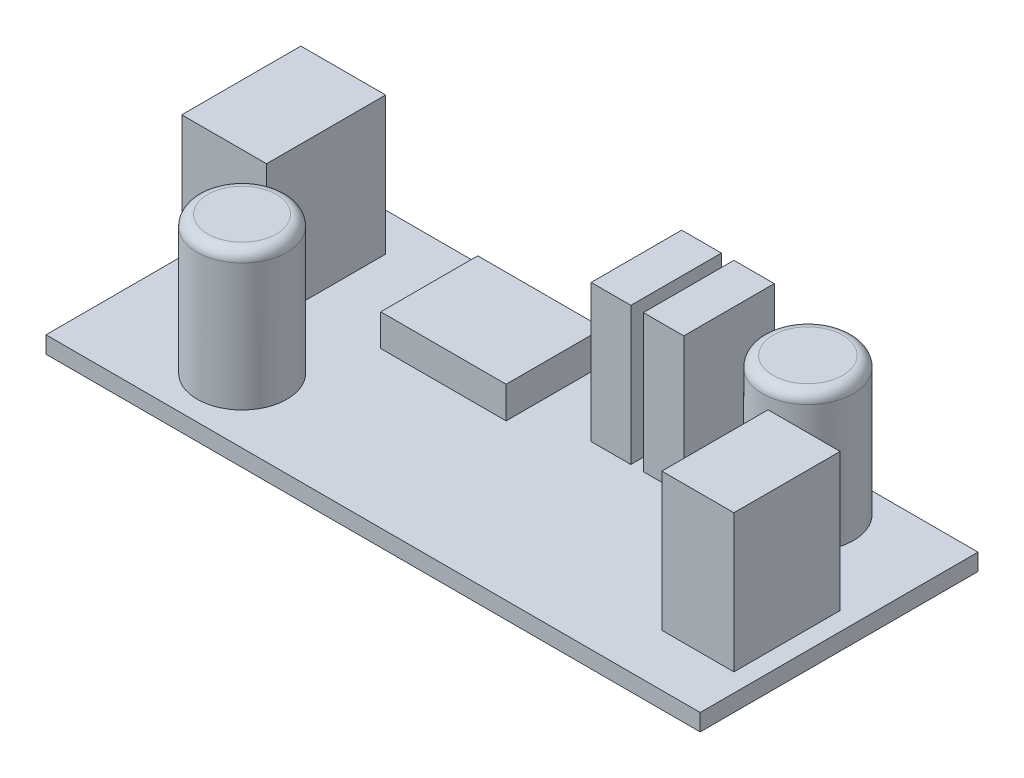
ISO-10303-21;
HEADER;
FILE_DESCRIPTION(('STEP AP214'),'2;1');
FILE_NAME('part.step','',(''),(''),'','','');
FILE_SCHEMA(('AUTOMOTIVE_DESIGN { 1 0 10303 214 1 1 1 1 }'));
ENDSEC;
DATA;
#1=APPLICATION_CONTEXT('core data for automotive mechanical design processes');
#2=APPLICATION_PROTOCOL_DEFINITION('international standard','automotive_design',2000,#1);
#3=PRODUCT_CONTEXT('',#1,'mechanical');
#4=PRODUCT('Part','Part','',(#3));
#5=PRODUCT_RELATED_PRODUCT_CATEGORY('part','',(#4));
#6=PRODUCT_DEFINITION_FORMATION('','',#4);
#7=PRODUCT_DEFINITION_CONTEXT('part definition',#1,'design');
#8=PRODUCT_DEFINITION('design','',#6,#7);
#9=PRODUCT_DEFINITION_SHAPE('','',#8);
#10=(LENGTH_UNIT() NAMED_UNIT(*) SI_UNIT(.MILLI.,.METRE.));
#11=(NAMED_UNIT(*) PLANE_ANGLE_UNIT() SI_UNIT($,.RADIAN.));
#12=(NAMED_UNIT(*) SI_UNIT($,.STERADIAN.) SOLID_ANGLE_UNIT());
#13=UNCERTAINTY_MEASURE_WITH_UNIT(LENGTH_MEASURE(1.E-05),#10,'distance_accuracy_value','');
#14=(GEOMETRIC_REPRESENTATION_CONTEXT(3) GLOBAL_UNCERTAINTY_ASSIGNED_CONTEXT((#13)) GLOBAL_UNIT_ASSIGNED_CONTEXT((#10,
#11,#12)) REPRESENTATION_CONTEXT('',''));
#15=CARTESIAN_POINT('',(0.,0.,0.));
#16=DIRECTION('',(0.,0.,1.));
#17=DIRECTION('',(1.,0.,0.));
#18=AXIS2_PLACEMENT_3D('',#15,#16,#17);
#19=CARTESIAN_POINT('',(0.,1.59,0.));
#20=DIRECTION('',(0.,-1.,0.));
#21=DIRECTION('',(0.,0.,-1.));
#22=AXIS2_PLACEMENT_3D('',#19,#20,#21);
#23=PLANE('',#22);
#24=CARTESIAN_POINT('',(12.398624263227,1.59,-6.0956552254664));
#25=DIRECTION('',(0.,-1.,0.));
#26=DIRECTION('',(0.,0.,-1.));
#27=AXIS2_PLACEMENT_3D('',#24,#25,#26);
#28=CIRCLE('',#27,4.23346182279782);
#29=CARTESIAN_POINT('',(12.398624263227,1.59,-10.3291170482642));
#30=VERTEX_POINT('',#29);
#31=EDGE_CURVE('E386',#30,#30,#28,.F.);
#32=ORIENTED_EDGE('',*,*,#31,.F.);
#33=EDGE_LOOP('',(#32));
#34=FACE_BOUND('',#33,.T.);
#35=DIRECTION('',(0.,0.,1.));
#36=VECTOR('',#35,1.);
#37=CARTESIAN_POINT('',(39.3579489685933,1.59,-25.5244355498974));
#38=LINE('',#37,#36);
#39=CARTESIAN_POINT('',(39.3579489685933,1.59,-25.5244355498974));
#40=VERTEX_POINT('',#39);
#41=CARTESIAN_POINT('',(39.3579489685933,1.59,-16.9866949518898));
#42=VERTEX_POINT('',#41);
#43=EDGE_CURVE('E216',#40,#42,#38,.T.);
#44=ORIENTED_EDGE('',*,*,#43,.F.);
#45=DIRECTION('',(-1.,0.,0.));
#46=VECTOR('',#45,1.);
#47=CARTESIAN_POINT('',(39.3579489685933,1.59,-25.5244355498974));
#48=LINE('',#47,#46);
#49=CARTESIAN_POINT('',(43.1627428834531,1.59,-25.5244355498974));
#50=VERTEX_POINT('',#49);
#51=EDGE_CURVE('E229',#50,#40,#48,.T.);
#52=ORIENTED_EDGE('',*,*,#51,.F.);
#53=DIRECTION('',(0.,0.,-1.));
#54=VECTOR('',#53,1.);
#55=CARTESIAN_POINT('',(43.1627428834531,1.59,-25.5244355498974));
#56=LINE('',#55,#54);
#57=CARTESIAN_POINT('',(43.1627428834531,1.59,-16.9866949518898));
#58=VERTEX_POINT('',#57);
#59=EDGE_CURVE('E238',#58,#50,#56,.T.);
#60=ORIENTED_EDGE('',*,*,#59,.F.);
#61=DIRECTION('',(1.,0.,0.));
#62=VECTOR('',#61,1.);
#63=CARTESIAN_POINT('',(39.3579489685933,1.59,-16.9866949518898));
#64=LINE('',#63,#62);
#65=EDGE_CURVE('E219',#42,#58,#64,.T.);
#66=ORIENTED_EDGE('',*,*,#65,.F.);
#67=EDGE_LOOP('',(#44,#52,#60,#66));
#68=FACE_BOUND('',#67,.T.);
#69=DIRECTION('',(0.,0.,1.));
#70=VECTOR('',#69,1.);
#71=CARTESIAN_POINT('',(53.1758245260932,1.59,-14.9218329152525));
#72=LINE('',#71,#70);
#73=CARTESIAN_POINT('',(53.1758245260932,1.59,-14.9218329152525));
#74=VERTEX_POINT('',#73);
#75=CARTESIAN_POINT('',(53.1758245260932,1.59,-4.90639908178636));
#76=VERTEX_POINT('',#75);
#77=EDGE_CURVE('E287',#74,#76,#72,.T.);
#78=ORIENTED_EDGE('',*,*,#77,.F.);
#79=DIRECTION('',(-1.,0.,0.));
#80=VECTOR('',#79,1.);
#81=CARTESIAN_POINT('',(53.1758245260932,1.59,-14.9218329152525));
#82=LINE('',#81,#80);
#83=CARTESIAN_POINT('',(59.9732286864523,1.59,-14.9218329152525));
#84=VERTEX_POINT('',#83);
#85=EDGE_CURVE('E292',#84,#74,#82,.T.);
#86=ORIENTED_EDGE('',*,*,#85,.F.);
#87=DIRECTION('',(0.,0.,-1.));
#88=VECTOR('',#87,1.);
#89=CARTESIAN_POINT('',(59.9732286864523,1.59,-14.9218329152525));
#90=LINE('',#89,#88);
#91=CARTESIAN_POINT('',(59.9732286864523,1.59,-4.90639908178636));
#92=VERTEX_POINT('',#91);
#93=EDGE_CURVE('E304',#92,#84,#90,.T.);
#94=ORIENTED_EDGE('',*,*,#93,.F.);
#95=DIRECTION('',(1.,0.,0.));
#96=VECTOR('',#95,1.);
#97=CARTESIAN_POINT('',(53.1758245260932,1.59,-4.90639908178636));
#98=LINE('',#97,#96);
#99=EDGE_CURVE('E301',#76,#92,#98,.T.);
#100=ORIENTED_EDGE('',*,*,#99,.F.);
#101=EDGE_LOOP('',(#78,#86,#94,#100));
#102=FACE_BOUND('',#101,.T.);
#103=DIRECTION('',(0.,0.,1.));
#104=VECTOR('',#103,1.);
#105=CARTESIAN_POINT('',(0.,1.59,0.));
#106=LINE('',#105,#104);
#107=CARTESIAN_POINT('',(0.,1.59,-26.2));
#108=VERTEX_POINT('',#107);
#109=CARTESIAN_POINT('',(0.,1.59,0.));
#110=VERTEX_POINT('',#109);
#111=EDGE_CURVE('E354',#108,#110,#106,.T.);
#112=ORIENTED_EDGE('',*,*,#111,.T.);
#113=DIRECTION('',(1.,0.,0.));
#114=VECTOR('',#113,1.);
#115=CARTESIAN_POINT('',(0.,1.59,0.));
#116=LINE('',#115,#114);
#117=CARTESIAN_POINT('',(61.7,1.59,0.));
#118=VERTEX_POINT('',#117);
#119=EDGE_CURVE('E357',#110,#118,#116,.T.);
#120=ORIENTED_EDGE('',*,*,#119,.T.);
#121=DIRECTION('',(0.,0.,-1.));
#122=VECTOR('',#121,1.);
#123=CARTESIAN_POINT('',(61.7,1.59,0.));
#124=LINE('',#123,#122);
#125=CARTESIAN_POINT('',(61.7,1.59,-26.2));
#126=VERTEX_POINT('',#125);
#127=EDGE_CURVE('E360',#118,#126,#124,.T.);
#128=ORIENTED_EDGE('',*,*,#127,.T.);
#129=DIRECTION('',(-1.,0.,0.));
#130=VECTOR('',#129,1.);
#131=CARTESIAN_POINT('',(0.,1.59,-26.2));
#132=LINE('',#131,#130);
#133=EDGE_CURVE('E362',#126,#108,#132,.T.);
#134=ORIENTED_EDGE('',*,*,#133,.T.);
#135=EDGE_LOOP('',(#112,#120,#128,#134));
#136=FACE_BOUND('',#135,.T.);
#137=DIRECTION('',(0.,0.,1.));
#138=VECTOR('',#137,1.);
#139=CARTESIAN_POINT('',(1.43322798709278,1.59,-22.6025100277512));
#140=LINE('',#139,#138);
#141=CARTESIAN_POINT('',(1.43322798709278,1.59,-22.6025100277512));
#142=VERTEX_POINT('',#141);
#143=CARTESIAN_POINT('',(1.43322798709278,1.59,-11.3708798760284));
#144=VERTEX_POINT('',#143);
#145=EDGE_CURVE('E320',#142,#144,#140,.T.);
#146=ORIENTED_EDGE('',*,*,#145,.F.);
#147=DIRECTION('',(-1.,0.,0.));
#148=VECTOR('',#147,1.);
#149=CARTESIAN_POINT('',(1.43322798709278,1.59,-22.6025100277512));
#150=LINE('',#149,#148);
#151=CARTESIAN_POINT('',(9.42951907842371,1.59,-22.6025100277512));
#152=VERTEX_POINT('',#151);
#153=EDGE_CURVE('E325',#152,#142,#150,.T.);
#154=ORIENTED_EDGE('',*,*,#153,.F.);
#155=DIRECTION('',(0.,0.,-1.));
#156=VECTOR('',#155,1.);
#157=CARTESIAN_POINT('',(9.42951907842371,1.59,-22.6025100277512));
#158=LINE('',#157,#156);
#159=CARTESIAN_POINT('',(9.42951907842371,1.59,-11.3708798760284));
#160=VERTEX_POINT('',#159);
#161=EDGE_CURVE('E337',#160,#152,#158,.T.);
#162=ORIENTED_EDGE('',*,*,#161,.F.);
#163=DIRECTION('',(1.,0.,0.));
#164=VECTOR('',#163,1.);
#165=CARTESIAN_POINT('',(1.43322798709278,1.59,-11.3708798760284));
#166=LINE('',#165,#164);
#167=EDGE_CURVE('E334',#144,#160,#166,.T.);
#168=ORIENTED_EDGE('',*,*,#167,.F.);
#169=EDGE_LOOP('',(#146,#154,#162,#168));
#170=FACE_BOUND('',#169,.T.);
#171=DIRECTION('',(0.,0.,1.));
#172=VECTOR('',#171,1.);
#173=CARTESIAN_POINT('',(34.429265792177,1.59,-25.5244355498974));
#174=LINE('',#173,#172);
#175=CARTESIAN_POINT('',(34.429265792177,1.59,-25.5244355498974));
#176=VERTEX_POINT('',#175);
#177=CARTESIAN_POINT('',(34.429265792177,1.59,-16.9866949518898));
#178=VERTEX_POINT('',#177);
#179=EDGE_CURVE('E254',#176,#178,#174,.T.);
#180=ORIENTED_EDGE('',*,*,#179,.F.);
#181=DIRECTION('',(-1.,0.,0.));
#182=VECTOR('',#181,1.);
#183=CARTESIAN_POINT('',(34.429265792177,1.59,-25.5244355498974));
#184=LINE('',#183,#182);
#185=CARTESIAN_POINT('',(38.1737413464904,1.59,-25.5244355498974));
#186=VERTEX_POINT('',#185);
#187=EDGE_CURVE('E259',#186,#176,#184,.T.);
#188=ORIENTED_EDGE('',*,*,#187,.F.);
#189=DIRECTION('',(0.,0.,-1.));
#190=VECTOR('',#189,1.);
#191=CARTESIAN_POINT('',(38.1737413464904,1.59,-25.5244355498974));
#192=LINE('',#191,#190);
#193=CARTESIAN_POINT('',(38.1737413464904,1.59,-16.9866949518898));
#194=VERTEX_POINT('',#193);
#195=EDGE_CURVE('E271',#194,#186,#192,.T.);
#196=ORIENTED_EDGE('',*,*,#195,.F.);
#197=DIRECTION('',(1.,0.,0.));
#198=VECTOR('',#197,1.);
#199=CARTESIAN_POINT('',(34.429265792177,1.59,-16.9866949518898));
#200=LINE('',#199,#198);
#201=EDGE_CURVE('E268',#178,#194,#200,.T.);
#202=ORIENTED_EDGE('',*,*,#201,.F.);
#203=EDGE_LOOP('',(#180,#188,#196,#202));
#204=FACE_BOUND('',#203,.T.);
#205=CARTESIAN_POINT('',(50.6011950510867,1.59,-21.2555652508936));
#206=DIRECTION('',(0.,-1.,0.));
#207=DIRECTION('',(0.,0.,-1.));
#208=AXIS2_PLACEMENT_3D('',#205,#206,#207);
#209=CIRCLE('',#208,4.28421693215345);
#210=CARTESIAN_POINT('',(50.6011950510867,1.59,-25.539782183047));
#211=VERTEX_POINT('',#210);
#212=EDGE_CURVE('E383',#211,#211,#209,.F.);
#213=ORIENTED_EDGE('',*,*,#212,.F.);
#214=EDGE_LOOP('',(#213));
#215=FACE_BOUND('',#214,.T.);
#216=DIRECTION('',(0.,0.,1.));
#217=VECTOR('',#216,1.);
#218=CARTESIAN_POINT('',(16.9088751946092,1.59,-23.8112295997852));
#219=LINE('',#218,#217);
#220=CARTESIAN_POINT('',(16.9088751946092,1.59,-23.8112295997852));
#221=VERTEX_POINT('',#220);
#222=CARTESIAN_POINT('',(16.9088751946092,1.59,-14.6618184301883));
#223=VERTEX_POINT('',#222);
#224=EDGE_CURVE('E215',#221,#223,#219,.T.);
#225=ORIENTED_EDGE('',*,*,#224,.F.);
#226=DIRECTION('',(-1.,0.,0.));
#227=VECTOR('',#226,1.);
#228=CARTESIAN_POINT('',(16.9088751946092,1.59,-23.8112295997852));
#229=LINE('',#228,#227);
#230=CARTESIAN_POINT('',(28.7336803821319,1.59,-23.8112295997852));
#231=VERTEX_POINT('',#230);
#232=EDGE_CURVE('E212',#231,#221,#229,.T.);
#233=ORIENTED_EDGE('',*,*,#232,.F.);
#234=DIRECTION('',(0.,0.,-1.));
#235=VECTOR('',#234,1.);
#236=CARTESIAN_POINT('',(28.7336803821319,1.59,-23.8112295997852));
#237=LINE('',#236,#235);
#238=CARTESIAN_POINT('',(28.7336803821319,1.59,-14.6618184301883));
#239=VERTEX_POINT('',#238);
#240=EDGE_CURVE('E54',#239,#231,#237,.T.);
#241=ORIENTED_EDGE('',*,*,#240,.F.);
#242=DIRECTION('',(1.,0.,0.));
#243=VECTOR('',#242,1.);
#244=CARTESIAN_POINT('',(16.9088751946092,1.59,-14.6618184301883));
#245=LINE('',#244,#243);
#246=EDGE_CURVE('E49',#223,#239,#245,.T.);
#247=ORIENTED_EDGE('',*,*,#246,.F.);
#248=EDGE_LOOP('',(#225,#233,#241,#247));
#249=FACE_BOUND('',#248,.T.);
#250=ADVANCED_FACE('F34',(#34,#68,#102,#136,#170,#204,#215,#249),#23,.F.);
#251=CARTESIAN_POINT('',(0.,1.59,0.));
#252=DIRECTION('',(1.,0.,0.));
#253=DIRECTION('',(0.,0.,-1.));
#254=AXIS2_PLACEMENT_3D('',#251,#252,#253);
#255=PLANE('',#254);
#256=DIRECTION('',(0.,0.,1.));
#257=VECTOR('',#256,1.);
#258=CARTESIAN_POINT('',(0.,0.,0.));
#259=LINE('',#258,#257);
#260=CARTESIAN_POINT('',(0.,0.,-26.2));
#261=VERTEX_POINT('',#260);
#262=CARTESIAN_POINT('',(0.,0.,0.));
#263=VERTEX_POINT('',#262);
#264=EDGE_CURVE('E353',#261,#263,#259,.T.);
#265=ORIENTED_EDGE('',*,*,#264,.T.);
#266=DIRECTION('',(0.,-1.,0.));
#267=VECTOR('',#266,1.);
#268=CARTESIAN_POINT('',(0.,1.59,0.));
#269=LINE('',#268,#267);
#270=EDGE_CURVE('E380',#110,#263,#269,.T.);
#271=ORIENTED_EDGE('',*,*,#270,.F.);
#272=ORIENTED_EDGE('',*,*,#111,.F.);
#273=DIRECTION('',(0.,-1.,0.));
#274=VECTOR('',#273,1.);
#275=CARTESIAN_POINT('',(0.,1.59,-26.2));
#276=LINE('',#275,#274);
#277=EDGE_CURVE('E364',#108,#261,#276,.T.);
#278=ORIENTED_EDGE('',*,*,#277,.T.);
#279=EDGE_LOOP('',(#265,#271,#272,#278));
#280=FACE_BOUND('',#279,.T.);
#281=ADVANCED_FACE('F410',(#280),#255,.F.);
#282=CARTESIAN_POINT('',(0.,1.59,0.));
#283=DIRECTION('',(0.,0.,-1.));
#284=DIRECTION('',(-1.,0.,0.));
#285=AXIS2_PLACEMENT_3D('',#282,#283,#284);
#286=PLANE('',#285);
#287=DIRECTION('',(1.,0.,0.));
#288=VECTOR('',#287,1.);
#289=CARTESIAN_POINT('',(0.,0.,0.));
#290=LINE('',#289,#288);
#291=CARTESIAN_POINT('',(61.7,0.,0.));
#292=VERTEX_POINT('',#291);
#293=EDGE_CURVE('E367',#263,#292,#290,.T.);
#294=ORIENTED_EDGE('',*,*,#293,.T.);
#295=DIRECTION('',(0.,-1.,0.));
#296=VECTOR('',#295,1.);
#297=CARTESIAN_POINT('',(61.7,1.59,0.));
#298=LINE('',#297,#296);
#299=EDGE_CURVE('E377',#118,#292,#298,.T.);
#300=ORIENTED_EDGE('',*,*,#299,.F.);
#301=ORIENTED_EDGE('',*,*,#119,.F.);
#302=ORIENTED_EDGE('',*,*,#270,.T.);
#303=EDGE_LOOP('',(#294,#300,#301,#302));
#304=FACE_BOUND('',#303,.T.);
#305=ADVANCED_FACE('F416',(#304),#286,.F.);
#306=CARTESIAN_POINT('',(61.7,1.59,0.));
#307=DIRECTION('',(-1.,0.,0.));
#308=DIRECTION('',(0.,0.,1.));
#309=AXIS2_PLACEMENT_3D('',#306,#307,#308);
#310=PLANE('',#309);
#311=DIRECTION('',(0.,0.,-1.));
#312=VECTOR('',#311,1.);
#313=CARTESIAN_POINT('',(61.7,0.,0.));
#314=LINE('',#313,#312);
#315=CARTESIAN_POINT('',(61.7,0.,-26.2));
#316=VERTEX_POINT('',#315);
#317=EDGE_CURVE('E369',#292,#316,#314,.T.);
#318=ORIENTED_EDGE('',*,*,#317,.T.);
#319=DIRECTION('',(0.,-1.,0.));
#320=VECTOR('',#319,1.);
#321=CARTESIAN_POINT('',(61.7,1.59,-26.2));
#322=LINE('',#321,#320);
#323=EDGE_CURVE('E374',#126,#316,#322,.T.);
#324=ORIENTED_EDGE('',*,*,#323,.F.);
#325=ORIENTED_EDGE('',*,*,#127,.F.);
#326=ORIENTED_EDGE('',*,*,#299,.T.);
#327=EDGE_LOOP('',(#318,#324,#325,#326));
#328=FACE_BOUND('',#327,.T.);
#329=ADVANCED_FACE('F432',(#328),#310,.F.);
#330=CARTESIAN_POINT('',(0.,1.59,-26.2));
#331=DIRECTION('',(0.,0.,1.));
#332=DIRECTION('',(1.,0.,0.));
#333=AXIS2_PLACEMENT_3D('',#330,#331,#332);
#334=PLANE('',#333);
#335=DIRECTION('',(-1.,0.,0.));
#336=VECTOR('',#335,1.);
#337=CARTESIAN_POINT('',(0.,0.,-26.2));
#338=LINE('',#337,#336);
#339=EDGE_CURVE('E358',#316,#261,#338,.T.);
#340=ORIENTED_EDGE('',*,*,#339,.T.);
#341=ORIENTED_EDGE('',*,*,#277,.F.);
#342=ORIENTED_EDGE('',*,*,#133,.F.);
#343=ORIENTED_EDGE('',*,*,#323,.T.);
#344=EDGE_LOOP('',(#340,#341,#342,#343));
#345=FACE_BOUND('',#344,.T.);
#346=ADVANCED_FACE('F428',(#345),#334,.F.);
#347=CARTESIAN_POINT('',(0.,0.,0.));
#348=DIRECTION('',(0.,-1.,0.));
#349=DIRECTION('',(0.,0.,-1.));
#350=AXIS2_PLACEMENT_3D('',#347,#348,#349);
#351=PLANE('',#350);
#352=ORIENTED_EDGE('',*,*,#264,.F.);
#353=ORIENTED_EDGE('',*,*,#339,.F.);
#354=ORIENTED_EDGE('',*,*,#317,.F.);
#355=ORIENTED_EDGE('',*,*,#293,.F.);
#356=EDGE_LOOP('',(#352,#353,#354,#355));
#357=FACE_BOUND('',#356,.T.);
#358=ADVANCED_FACE('F425',(#357),#351,.T.);
#359=CARTESIAN_POINT('',(1.43322798709278,14.59,-22.6025100277512));
#360=DIRECTION('',(1.,0.,0.));
#361=DIRECTION('',(0.,0.,-1.));
#362=AXIS2_PLACEMENT_3D('',#359,#360,#361);
#363=PLANE('',#362);
#364=ORIENTED_EDGE('',*,*,#145,.T.);
#365=DIRECTION('',(0.,-1.,0.));
#366=VECTOR('',#365,1.);
#367=CARTESIAN_POINT('',(1.43322798709278,14.59,-11.3708798760284));
#368=LINE('',#367,#366);
#369=CARTESIAN_POINT('',(1.43322798709278,14.59,-11.3708798760284));
#370=VERTEX_POINT('',#369);
#371=EDGE_CURVE('E350',#370,#144,#368,.T.);
#372=ORIENTED_EDGE('',*,*,#371,.F.);
#373=DIRECTION('',(0.,0.,1.));
#374=VECTOR('',#373,1.);
#375=CARTESIAN_POINT('',(1.43322798709278,14.59,-22.6025100277512));
#376=LINE('',#375,#374);
#377=CARTESIAN_POINT('',(1.43322798709278,14.59,-22.6025100277512));
#378=VERTEX_POINT('',#377);
#379=EDGE_CURVE('E321',#378,#370,#376,.T.);
#380=ORIENTED_EDGE('',*,*,#379,.F.);
#381=DIRECTION('',(0.,-1.,0.));
#382=VECTOR('',#381,1.);
#383=CARTESIAN_POINT('',(1.43322798709278,14.59,-22.6025100277512));
#384=LINE('',#383,#382);
#385=EDGE_CURVE('E331',#378,#142,#384,.T.);
#386=ORIENTED_EDGE('',*,*,#385,.T.);
#387=EDGE_LOOP('',(#364,#372,#380,#386));
#388=FACE_BOUND('',#387,.T.);
#389=ADVANCED_FACE('F423',(#388),#363,.F.);
#390=CARTESIAN_POINT('',(1.43322798709278,14.59,-11.3708798760284));
#391=DIRECTION('',(0.,0.,-1.));
#392=DIRECTION('',(-1.,0.,0.));
#393=AXIS2_PLACEMENT_3D('',#390,#391,#392);
#394=PLANE('',#393);
#395=ORIENTED_EDGE('',*,*,#167,.T.);
#396=DIRECTION('',(0.,-1.,0.));
#397=VECTOR('',#396,1.);
#398=CARTESIAN_POINT('',(9.42951907842371,14.59,-11.3708798760284));
#399=LINE('',#398,#397);
#400=CARTESIAN_POINT('',(9.42951907842371,14.59,-11.3708798760284));
#401=VERTEX_POINT('',#400);
#402=EDGE_CURVE('E347',#401,#160,#399,.T.);
#403=ORIENTED_EDGE('',*,*,#402,.F.);
#404=DIRECTION('',(1.,0.,0.));
#405=VECTOR('',#404,1.);
#406=CARTESIAN_POINT('',(1.43322798709278,14.59,-11.3708798760284));
#407=LINE('',#406,#405);
#408=EDGE_CURVE('E324',#370,#401,#407,.T.);
#409=ORIENTED_EDGE('',*,*,#408,.F.);
#410=ORIENTED_EDGE('',*,*,#371,.T.);
#411=EDGE_LOOP('',(#395,#403,#409,#410));
#412=FACE_BOUND('',#411,.T.);
#413=ADVANCED_FACE('F565',(#412),#394,.F.);
#414=CARTESIAN_POINT('',(9.42951907842371,14.59,-22.6025100277512));
#415=DIRECTION('',(-1.,0.,0.));
#416=DIRECTION('',(0.,0.,1.));
#417=AXIS2_PLACEMENT_3D('',#414,#415,#416);
#418=PLANE('',#417);
#419=ORIENTED_EDGE('',*,*,#161,.T.);
#420=DIRECTION('',(0.,-1.,0.));
#421=VECTOR('',#420,1.);
#422=CARTESIAN_POINT('',(9.42951907842371,14.59,-22.6025100277512));
#423=LINE('',#422,#421);
#424=CARTESIAN_POINT('',(9.42951907842371,14.59,-22.6025100277512));
#425=VERTEX_POINT('',#424);
#426=EDGE_CURVE('E344',#425,#152,#423,.T.);
#427=ORIENTED_EDGE('',*,*,#426,.F.);
#428=DIRECTION('',(0.,0.,-1.));
#429=VECTOR('',#428,1.);
#430=CARTESIAN_POINT('',(9.42951907842371,14.59,-22.6025100277512));
#431=LINE('',#430,#429);
#432=EDGE_CURVE('E327',#401,#425,#431,.T.);
#433=ORIENTED_EDGE('',*,*,#432,.F.);
#434=ORIENTED_EDGE('',*,*,#402,.T.);
#435=EDGE_LOOP('',(#419,#427,#433,#434));
#436=FACE_BOUND('',#435,.T.);
#437=ADVANCED_FACE('F562',(#436),#418,.F.);
#438=CARTESIAN_POINT('',(1.43322798709278,14.59,-22.6025100277512));
#439=DIRECTION('',(0.,0.,1.));
#440=DIRECTION('',(1.,0.,0.));
#441=AXIS2_PLACEMENT_3D('',#438,#439,#440);
#442=PLANE('',#441);
#443=ORIENTED_EDGE('',*,*,#153,.T.);
#444=ORIENTED_EDGE('',*,*,#385,.F.);
#445=DIRECTION('',(-1.,0.,0.));
#446=VECTOR('',#445,1.);
#447=CARTESIAN_POINT('',(1.43322798709278,14.59,-22.6025100277512));
#448=LINE('',#447,#446);
#449=EDGE_CURVE('E329',#425,#378,#448,.T.);
#450=ORIENTED_EDGE('',*,*,#449,.F.);
#451=ORIENTED_EDGE('',*,*,#426,.T.);
#452=EDGE_LOOP('',(#443,#444,#450,#451));
#453=FACE_BOUND('',#452,.T.);
#454=ADVANCED_FACE('F558',(#453),#442,.F.);
#455=CARTESIAN_POINT('',(0.,14.59,0.));
#456=DIRECTION('',(0.,1.,0.));
#457=DIRECTION('',(0.,0.,1.));
#458=AXIS2_PLACEMENT_3D('',#455,#456,#457);
#459=PLANE('',#458);
#460=ORIENTED_EDGE('',*,*,#379,.T.);
#461=ORIENTED_EDGE('',*,*,#408,.T.);
#462=ORIENTED_EDGE('',*,*,#432,.T.);
#463=ORIENTED_EDGE('',*,*,#449,.T.);
#464=EDGE_LOOP('',(#460,#461,#462,#463));
#465=FACE_BOUND('',#464,.T.);
#466=ADVANCED_FACE('F554',(#465),#459,.T.);
#467=CARTESIAN_POINT('',(53.1758245260932,14.59,-14.9218329152525));
#468=DIRECTION('',(1.,0.,0.));
#469=DIRECTION('',(0.,0.,-1.));
#470=AXIS2_PLACEMENT_3D('',#467,#468,#469);
#471=PLANE('',#470);
#472=ORIENTED_EDGE('',*,*,#77,.T.);
#473=DIRECTION('',(0.,-1.,0.));
#474=VECTOR('',#473,1.);
#475=CARTESIAN_POINT('',(53.1758245260932,14.59,-4.90639908178636));
#476=LINE('',#475,#474);
#477=CARTESIAN_POINT('',(53.1758245260932,14.59,-4.90639908178636));
#478=VERTEX_POINT('',#477);
#479=EDGE_CURVE('E317',#478,#76,#476,.T.);
#480=ORIENTED_EDGE('',*,*,#479,.F.);
#481=DIRECTION('',(0.,0.,1.));
#482=VECTOR('',#481,1.);
#483=CARTESIAN_POINT('',(53.1758245260932,14.59,-14.9218329152525));
#484=LINE('',#483,#482);
#485=CARTESIAN_POINT('',(53.1758245260932,14.59,-14.9218329152525));
#486=VERTEX_POINT('',#485);
#487=EDGE_CURVE('E288',#486,#478,#484,.T.);
#488=ORIENTED_EDGE('',*,*,#487,.F.);
#489=DIRECTION('',(0.,-1.,0.));
#490=VECTOR('',#489,1.);
#491=CARTESIAN_POINT('',(53.1758245260932,14.59,-14.9218329152525));
#492=LINE('',#491,#490);
#493=EDGE_CURVE('E298',#486,#74,#492,.T.);
#494=ORIENTED_EDGE('',*,*,#493,.T.);
#495=EDGE_LOOP('',(#472,#480,#488,#494));
#496=FACE_BOUND('',#495,.T.);
#497=ADVANCED_FACE('F550',(#496),#471,.F.);
#498=CARTESIAN_POINT('',(53.1758245260932,14.59,-4.90639908178636));
#499=DIRECTION('',(0.,0.,-1.));
#500=DIRECTION('',(-1.,0.,0.));
#501=AXIS2_PLACEMENT_3D('',#498,#499,#500);
#502=PLANE('',#501);
#503=ORIENTED_EDGE('',*,*,#99,.T.);
#504=DIRECTION('',(0.,-1.,0.));
#505=VECTOR('',#504,1.);
#506=CARTESIAN_POINT('',(59.9732286864523,14.59,-4.90639908178636));
#507=LINE('',#506,#505);
#508=CARTESIAN_POINT('',(59.9732286864523,14.59,-4.90639908178636));
#509=VERTEX_POINT('',#508);
#510=EDGE_CURVE('E314',#509,#92,#507,.T.);
#511=ORIENTED_EDGE('',*,*,#510,.F.);
#512=DIRECTION('',(1.,0.,0.));
#513=VECTOR('',#512,1.);
#514=CARTESIAN_POINT('',(53.1758245260932,14.59,-4.90639908178636));
#515=LINE('',#514,#513);
#516=EDGE_CURVE('E291',#478,#509,#515,.T.);
#517=ORIENTED_EDGE('',*,*,#516,.F.);
#518=ORIENTED_EDGE('',*,*,#479,.T.);
#519=EDGE_LOOP('',(#503,#511,#517,#518));
#520=FACE_BOUND('',#519,.T.);
#521=ADVANCED_FACE('F546',(#520),#502,.F.);
#522=CARTESIAN_POINT('',(59.9732286864523,14.59,-14.9218329152525));
#523=DIRECTION('',(-1.,0.,0.));
#524=DIRECTION('',(0.,0.,1.));
#525=AXIS2_PLACEMENT_3D('',#522,#523,#524);
#526=PLANE('',#525);
#527=ORIENTED_EDGE('',*,*,#93,.T.);
#528=DIRECTION('',(0.,-1.,0.));
#529=VECTOR('',#528,1.);
#530=CARTESIAN_POINT('',(59.9732286864523,14.59,-14.9218329152525));
#531=LINE('',#530,#529);
#532=CARTESIAN_POINT('',(59.9732286864523,14.59,-14.9218329152525));
#533=VERTEX_POINT('',#532);
#534=EDGE_CURVE('E311',#533,#84,#531,.T.);
#535=ORIENTED_EDGE('',*,*,#534,.F.);
#536=DIRECTION('',(0.,0.,-1.));
#537=VECTOR('',#536,1.);
#538=CARTESIAN_POINT('',(59.9732286864523,14.59,-14.9218329152525));
#539=LINE('',#538,#537);
#540=EDGE_CURVE('E294',#509,#533,#539,.T.);
#541=ORIENTED_EDGE('',*,*,#540,.F.);
#542=ORIENTED_EDGE('',*,*,#510,.T.);
#543=EDGE_LOOP('',(#527,#535,#541,#542));
#544=FACE_BOUND('',#543,.T.);
#545=ADVANCED_FACE('F542',(#544),#526,.F.);
#546=CARTESIAN_POINT('',(53.1758245260932,14.59,-14.9218329152525));
#547=DIRECTION('',(0.,0.,1.));
#548=DIRECTION('',(1.,0.,0.));
#549=AXIS2_PLACEMENT_3D('',#546,#547,#548);
#550=PLANE('',#549);
#551=ORIENTED_EDGE('',*,*,#85,.T.);
#552=ORIENTED_EDGE('',*,*,#493,.F.);
#553=DIRECTION('',(-1.,0.,0.));
#554=VECTOR('',#553,1.);
#555=CARTESIAN_POINT('',(53.1758245260932,14.59,-14.9218329152525));
#556=LINE('',#555,#554);
#557=EDGE_CURVE('E296',#533,#486,#556,.T.);
#558=ORIENTED_EDGE('',*,*,#557,.F.);
#559=ORIENTED_EDGE('',*,*,#534,.T.);
#560=EDGE_LOOP('',(#551,#552,#558,#559));
#561=FACE_BOUND('',#560,.T.);
#562=ADVANCED_FACE('F538',(#561),#550,.F.);
#563=CARTESIAN_POINT('',(0.,14.59,0.));
#564=DIRECTION('',(0.,1.,0.));
#565=DIRECTION('',(0.,0.,1.));
#566=AXIS2_PLACEMENT_3D('',#563,#564,#565);
#567=PLANE('',#566);
#568=ORIENTED_EDGE('',*,*,#487,.T.);
#569=ORIENTED_EDGE('',*,*,#516,.T.);
#570=ORIENTED_EDGE('',*,*,#540,.T.);
#571=ORIENTED_EDGE('',*,*,#557,.T.);
#572=EDGE_LOOP('',(#568,#569,#570,#571));
#573=FACE_BOUND('',#572,.T.);
#574=ADVANCED_FACE('F534',(#573),#567,.T.);
#575=CARTESIAN_POINT('',(34.429265792177,14.59,-25.5244355498974));
#576=DIRECTION('',(1.,0.,0.));
#577=DIRECTION('',(0.,0.,-1.));
#578=AXIS2_PLACEMENT_3D('',#575,#576,#577);
#579=PLANE('',#578);
#580=ORIENTED_EDGE('',*,*,#179,.T.);
#581=DIRECTION('',(0.,-1.,0.));
#582=VECTOR('',#581,1.);
#583=CARTESIAN_POINT('',(34.429265792177,14.59,-16.9866949518898));
#584=LINE('',#583,#582);
#585=CARTESIAN_POINT('',(34.429265792177,14.59,-16.9866949518898));
#586=VERTEX_POINT('',#585);
#587=EDGE_CURVE('E284',#586,#178,#584,.T.);
#588=ORIENTED_EDGE('',*,*,#587,.F.);
#589=DIRECTION('',(0.,0.,1.));
#590=VECTOR('',#589,1.);
#591=CARTESIAN_POINT('',(34.429265792177,14.59,-25.5244355498974));
#592=LINE('',#591,#590);
#593=CARTESIAN_POINT('',(34.429265792177,14.59,-25.5244355498974));
#594=VERTEX_POINT('',#593);
#595=EDGE_CURVE('E255',#594,#586,#592,.T.);
#596=ORIENTED_EDGE('',*,*,#595,.F.);
#597=DIRECTION('',(0.,-1.,0.));
#598=VECTOR('',#597,1.);
#599=CARTESIAN_POINT('',(34.429265792177,14.59,-25.5244355498974));
#600=LINE('',#599,#598);
#601=EDGE_CURVE('E265',#594,#176,#600,.T.);
#602=ORIENTED_EDGE('',*,*,#601,.T.);
#603=EDGE_LOOP('',(#580,#588,#596,#602));
#604=FACE_BOUND('',#603,.T.);
#605=ADVANCED_FACE('F530',(#604),#579,.F.);
#606=CARTESIAN_POINT('',(34.429265792177,14.59,-16.9866949518898));
#607=DIRECTION('',(0.,0.,-1.));
#608=DIRECTION('',(-1.,0.,0.));
#609=AXIS2_PLACEMENT_3D('',#606,#607,#608);
#610=PLANE('',#609);
#611=ORIENTED_EDGE('',*,*,#201,.T.);
#612=DIRECTION('',(0.,-1.,0.));
#613=VECTOR('',#612,1.);
#614=CARTESIAN_POINT('',(38.1737413464904,14.59,-16.9866949518898));
#615=LINE('',#614,#613);
#616=CARTESIAN_POINT('',(38.1737413464904,14.59,-16.9866949518898));
#617=VERTEX_POINT('',#616);
#618=EDGE_CURVE('E281',#617,#194,#615,.T.);
#619=ORIENTED_EDGE('',*,*,#618,.F.);
#620=DIRECTION('',(1.,0.,0.));
#621=VECTOR('',#620,1.);
#622=CARTESIAN_POINT('',(34.429265792177,14.59,-16.9866949518898));
#623=LINE('',#622,#621);
#624=EDGE_CURVE('E258',#586,#617,#623,.T.);
#625=ORIENTED_EDGE('',*,*,#624,.F.);
#626=ORIENTED_EDGE('',*,*,#587,.T.);
#627=EDGE_LOOP('',(#611,#619,#625,#626));
#628=FACE_BOUND('',#627,.T.);
#629=ADVANCED_FACE('F526',(#628),#610,.F.);
#630=CARTESIAN_POINT('',(38.1737413464904,14.59,-25.5244355498974));
#631=DIRECTION('',(-1.,0.,0.));
#632=DIRECTION('',(0.,0.,1.));
#633=AXIS2_PLACEMENT_3D('',#630,#631,#632);
#634=PLANE('',#633);
#635=ORIENTED_EDGE('',*,*,#195,.T.);
#636=DIRECTION('',(0.,-1.,0.));
#637=VECTOR('',#636,1.);
#638=CARTESIAN_POINT('',(38.1737413464904,14.59,-25.5244355498974));
#639=LINE('',#638,#637);
#640=CARTESIAN_POINT('',(38.1737413464904,14.59,-25.5244355498974));
#641=VERTEX_POINT('',#640);
#642=EDGE_CURVE('E278',#641,#186,#639,.T.);
#643=ORIENTED_EDGE('',*,*,#642,.F.);
#644=DIRECTION('',(0.,0.,-1.));
#645=VECTOR('',#644,1.);
#646=CARTESIAN_POINT('',(38.1737413464904,14.59,-25.5244355498974));
#647=LINE('',#646,#645);
#648=EDGE_CURVE('E261',#617,#641,#647,.T.);
#649=ORIENTED_EDGE('',*,*,#648,.F.);
#650=ORIENTED_EDGE('',*,*,#618,.T.);
#651=EDGE_LOOP('',(#635,#643,#649,#650));
#652=FACE_BOUND('',#651,.T.);
#653=ADVANCED_FACE('F522',(#652),#634,.F.);
#654=CARTESIAN_POINT('',(34.429265792177,14.59,-25.5244355498974));
#655=DIRECTION('',(0.,0.,1.));
#656=DIRECTION('',(1.,0.,0.));
#657=AXIS2_PLACEMENT_3D('',#654,#655,#656);
#658=PLANE('',#657);
#659=ORIENTED_EDGE('',*,*,#187,.T.);
#660=ORIENTED_EDGE('',*,*,#601,.F.);
#661=DIRECTION('',(-1.,0.,0.));
#662=VECTOR('',#661,1.);
#663=CARTESIAN_POINT('',(34.429265792177,14.59,-25.5244355498974));
#664=LINE('',#663,#662);
#665=EDGE_CURVE('E263',#641,#594,#664,.T.);
#666=ORIENTED_EDGE('',*,*,#665,.F.);
#667=ORIENTED_EDGE('',*,*,#642,.T.);
#668=EDGE_LOOP('',(#659,#660,#666,#667));
#669=FACE_BOUND('',#668,.T.);
#670=ADVANCED_FACE('F518',(#669),#658,.F.);
#671=CARTESIAN_POINT('',(0.,14.59,0.));
#672=DIRECTION('',(0.,1.,0.));
#673=DIRECTION('',(0.,0.,1.));
#674=AXIS2_PLACEMENT_3D('',#671,#672,#673);
#675=PLANE('',#674);
#676=ORIENTED_EDGE('',*,*,#595,.T.);
#677=ORIENTED_EDGE('',*,*,#624,.T.);
#678=ORIENTED_EDGE('',*,*,#648,.T.);
#679=ORIENTED_EDGE('',*,*,#665,.T.);
#680=EDGE_LOOP('',(#676,#677,#678,#679));
#681=FACE_BOUND('',#680,.T.);
#682=ADVANCED_FACE('F514',(#681),#675,.T.);
#683=CARTESIAN_POINT('',(39.3579489685933,14.59,-25.5244355498974));
#684=DIRECTION('',(1.,0.,0.));
#685=DIRECTION('',(0.,0.,-1.));
#686=AXIS2_PLACEMENT_3D('',#683,#684,#685);
#687=PLANE('',#686);
#688=ORIENTED_EDGE('',*,*,#43,.T.);
#689=DIRECTION('',(0.,-1.,0.));
#690=VECTOR('',#689,1.);
#691=CARTESIAN_POINT('',(39.3579489685933,14.59,-16.9866949518898));
#692=LINE('',#691,#690);
#693=CARTESIAN_POINT('',(39.3579489685933,14.59,-16.9866949518898));
#694=VERTEX_POINT('',#693);
#695=EDGE_CURVE('E251',#694,#42,#692,.T.);
#696=ORIENTED_EDGE('',*,*,#695,.F.);
#697=DIRECTION('',(0.,0.,1.));
#698=VECTOR('',#697,1.);
#699=CARTESIAN_POINT('',(39.3579489685933,14.59,-25.5244355498974));
#700=LINE('',#699,#698);
#701=CARTESIAN_POINT('',(39.3579489685933,14.59,-25.5244355498974));
#702=VERTEX_POINT('',#701);
#703=EDGE_CURVE('E225',#702,#694,#700,.T.);
#704=ORIENTED_EDGE('',*,*,#703,.F.);
#705=DIRECTION('',(0.,-1.,0.));
#706=VECTOR('',#705,1.);
#707=CARTESIAN_POINT('',(39.3579489685933,14.59,-25.5244355498974));
#708=LINE('',#707,#706);
#709=EDGE_CURVE('E234',#702,#40,#708,.T.);
#710=ORIENTED_EDGE('',*,*,#709,.T.);
#711=EDGE_LOOP('',(#688,#696,#704,#710));
#712=FACE_BOUND('',#711,.T.);
#713=ADVANCED_FACE('F510',(#712),#687,.F.);
#714=CARTESIAN_POINT('',(39.3579489685933,14.59,-16.9866949518898));
#715=DIRECTION('',(0.,0.,-1.));
#716=DIRECTION('',(-1.,0.,0.));
#717=AXIS2_PLACEMENT_3D('',#714,#715,#716);
#718=PLANE('',#717);
#719=ORIENTED_EDGE('',*,*,#65,.T.);
#720=DIRECTION('',(0.,-1.,0.));
#721=VECTOR('',#720,1.);
#722=CARTESIAN_POINT('',(43.1627428834531,14.59,-16.9866949518898));
#723=LINE('',#722,#721);
#724=CARTESIAN_POINT('',(43.1627428834531,14.59,-16.9866949518898));
#725=VERTEX_POINT('',#724);
#726=EDGE_CURVE('E248',#725,#58,#723,.T.);
#727=ORIENTED_EDGE('',*,*,#726,.F.);
#728=DIRECTION('',(1.,0.,0.));
#729=VECTOR('',#728,1.);
#730=CARTESIAN_POINT('',(39.3579489685933,14.59,-16.9866949518898));
#731=LINE('',#730,#729);
#732=EDGE_CURVE('E228',#694,#725,#731,.T.);
#733=ORIENTED_EDGE('',*,*,#732,.F.);
#734=ORIENTED_EDGE('',*,*,#695,.T.);
#735=EDGE_LOOP('',(#719,#727,#733,#734));
#736=FACE_BOUND('',#735,.T.);
#737=ADVANCED_FACE('F506',(#736),#718,.F.);
#738=CARTESIAN_POINT('',(43.1627428834531,14.59,-25.5244355498974));
#739=DIRECTION('',(-1.,0.,0.));
#740=DIRECTION('',(0.,0.,1.));
#741=AXIS2_PLACEMENT_3D('',#738,#739,#740);
#742=PLANE('',#741);
#743=ORIENTED_EDGE('',*,*,#59,.T.);
#744=DIRECTION('',(0.,-1.,0.));
#745=VECTOR('',#744,1.);
#746=CARTESIAN_POINT('',(43.1627428834531,14.59,-25.5244355498974));
#747=LINE('',#746,#745);
#748=CARTESIAN_POINT('',(43.1627428834531,14.59,-25.5244355498974));
#749=VERTEX_POINT('',#748);
#750=EDGE_CURVE('E245',#749,#50,#747,.T.);
#751=ORIENTED_EDGE('',*,*,#750,.F.);
#752=DIRECTION('',(0.,0.,-1.));
#753=VECTOR('',#752,1.);
#754=CARTESIAN_POINT('',(43.1627428834531,14.59,-25.5244355498974));
#755=LINE('',#754,#753);
#756=EDGE_CURVE('E231',#725,#749,#755,.T.);
#757=ORIENTED_EDGE('',*,*,#756,.F.);
#758=ORIENTED_EDGE('',*,*,#726,.T.);
#759=EDGE_LOOP('',(#743,#751,#757,#758));
#760=FACE_BOUND('',#759,.T.);
#761=ADVANCED_FACE('F502',(#760),#742,.F.);
#762=CARTESIAN_POINT('',(39.3579489685933,14.59,-25.5244355498974));
#763=DIRECTION('',(0.,0.,1.));
#764=DIRECTION('',(1.,0.,0.));
#765=AXIS2_PLACEMENT_3D('',#762,#763,#764);
#766=PLANE('',#765);
#767=ORIENTED_EDGE('',*,*,#51,.T.);
#768=ORIENTED_EDGE('',*,*,#709,.F.);
#769=DIRECTION('',(-1.,0.,0.));
#770=VECTOR('',#769,1.);
#771=CARTESIAN_POINT('',(39.3579489685933,14.59,-25.5244355498974));
#772=LINE('',#771,#770);
#773=EDGE_CURVE('E233',#749,#702,#772,.T.);
#774=ORIENTED_EDGE('',*,*,#773,.F.);
#775=ORIENTED_EDGE('',*,*,#750,.T.);
#776=EDGE_LOOP('',(#767,#768,#774,#775));
#777=FACE_BOUND('',#776,.T.);
#778=ADVANCED_FACE('F498',(#777),#766,.F.);
#779=CARTESIAN_POINT('',(0.,14.59,0.));
#780=DIRECTION('',(0.,1.,0.));
#781=DIRECTION('',(0.,0.,1.));
#782=AXIS2_PLACEMENT_3D('',#779,#780,#781);
#783=PLANE('',#782);
#784=ORIENTED_EDGE('',*,*,#703,.T.);
#785=ORIENTED_EDGE('',*,*,#732,.T.);
#786=ORIENTED_EDGE('',*,*,#756,.T.);
#787=ORIENTED_EDGE('',*,*,#773,.T.);
#788=EDGE_LOOP('',(#784,#785,#786,#787));
#789=FACE_BOUND('',#788,.T.);
#790=ADVANCED_FACE('F494',(#789),#783,.T.);
#791=CARTESIAN_POINT('',(50.6011950510867,14.59,-21.2555652508936));
#792=DIRECTION('',(0.,-1.,0.));
#793=DIRECTION('',(0.,0.,-1.));
#794=AXIS2_PLACEMENT_3D('',#791,#792,#793);
#795=CYLINDRICAL_SURFACE('',#794,4.28421693215345);
#796=CARTESIAN_POINT('',(50.6011950510867,13.59,-21.2555652508936));
#797=DIRECTION('',(0.,1.,0.));
#798=DIRECTION('',(0.,0.,1.));
#799=AXIS2_PLACEMENT_3D('',#796,#797,#798);
#800=CIRCLE('',#799,4.28421693215345);
#801=CARTESIAN_POINT('',(50.6011950510867,13.59,-16.9713483187401));
#802=VERTEX_POINT('',#801);
#803=EDGE_CURVE('E392',#802,#802,#800,.F.);
#804=ORIENTED_EDGE('',*,*,#803,.T.);
#805=EDGE_LOOP('',(#804));
#806=FACE_BOUND('',#805,.T.);
#807=ORIENTED_EDGE('',*,*,#212,.T.);
#808=EDGE_LOOP('',(#807));
#809=FACE_BOUND('',#808,.T.);
#810=ADVANCED_FACE('F490',(#806,#809),#795,.T.);
#811=CARTESIAN_POINT('',(50.6011950510867,14.59,-21.2555652508936));
#812=DIRECTION('',(0.,1.,0.));
#813=DIRECTION('',(0.,0.,1.));
#814=AXIS2_PLACEMENT_3D('',#811,#812,#813);
#815=PLANE('',#814);
#816=CARTESIAN_POINT('',(50.6011950510867,14.59,-21.2555652508936));
#817=DIRECTION('',(0.,1.,0.));
#818=DIRECTION('',(0.,0.,1.));
#819=AXIS2_PLACEMENT_3D('',#816,#817,#818);
#820=CIRCLE('',#819,3.28421693215345);
#821=CARTESIAN_POINT('',(50.6011950510867,14.59,-17.9713483187401));
#822=VERTEX_POINT('',#821);
#823=EDGE_CURVE('E389',#822,#822,#820,.T.);
#824=ORIENTED_EDGE('',*,*,#823,.T.);
#825=EDGE_LOOP('',(#824));
#826=FACE_BOUND('',#825,.T.);
#827=ADVANCED_FACE('F486',(#826),#815,.T.);
#828=CARTESIAN_POINT('',(12.398624263227,14.59,-6.0956552254664));
#829=DIRECTION('',(0.,-1.,0.));
#830=DIRECTION('',(0.,0.,-1.));
#831=AXIS2_PLACEMENT_3D('',#828,#829,#830);
#832=CYLINDRICAL_SURFACE('',#831,4.23346182279782);
#833=CARTESIAN_POINT('',(12.398624263227,13.59,-6.0956552254664));
#834=DIRECTION('',(0.,1.,0.));
#835=DIRECTION('',(0.,0.,1.));
#836=AXIS2_PLACEMENT_3D('',#833,#834,#835);
#837=CIRCLE('',#836,4.23346182279782);
#838=CARTESIAN_POINT('',(12.398624263227,13.59,-1.86219340266858));
#839=VERTEX_POINT('',#838);
#840=EDGE_CURVE('E11',#839,#839,#837,.F.);
#841=ORIENTED_EDGE('',*,*,#840,.T.);
#842=EDGE_LOOP('',(#841));
#843=FACE_BOUND('',#842,.T.);
#844=ORIENTED_EDGE('',*,*,#31,.T.);
#845=EDGE_LOOP('',(#844));
#846=FACE_BOUND('',#845,.T.);
#847=ADVANCED_FACE('F483',(#843,#846),#832,.T.);
#848=CARTESIAN_POINT('',(12.398624263227,14.59,-6.0956552254664));
#849=DIRECTION('',(0.,1.,0.));
#850=DIRECTION('',(0.,0.,1.));
#851=AXIS2_PLACEMENT_3D('',#848,#849,#850);
#852=PLANE('',#851);
#853=CARTESIAN_POINT('',(12.398624263227,14.59,-6.0956552254664));
#854=DIRECTION('',(0.,1.,0.));
#855=DIRECTION('',(0.,0.,1.));
#856=AXIS2_PLACEMENT_3D('',#853,#854,#855);
#857=CIRCLE('',#856,3.23346182279782);
#858=CARTESIAN_POINT('',(12.398624263227,14.59,-2.86219340266858));
#859=VERTEX_POINT('',#858);
#860=EDGE_CURVE('E42',#859,#859,#857,.T.);
#861=ORIENTED_EDGE('',*,*,#860,.T.);
#862=EDGE_LOOP('',(#861));
#863=FACE_BOUND('',#862,.T.);
#864=ADVANCED_FACE('F397',(#863),#852,.T.);
#865=CARTESIAN_POINT('',(50.6011950510867,13.59,-21.2555652508936));
#866=DIRECTION('',(0.,1.,0.));
#867=DIRECTION('',(0.,0.,1.));
#868=AXIS2_PLACEMENT_3D('',#865,#866,#867);
#869=TOROIDAL_SURFACE('',#868,3.28421693215345,1.);
#870=ORIENTED_EDGE('',*,*,#803,.F.);
#871=EDGE_LOOP('',(#870));
#872=FACE_BOUND('',#871,.T.);
#873=ORIENTED_EDGE('',*,*,#823,.F.);
#874=EDGE_LOOP('',(#873));
#875=FACE_BOUND('',#874,.T.);
#876=ADVANCED_FACE('F400',(#872,#875),#869,.T.);
#877=CARTESIAN_POINT('',(12.398624263227,13.59,-6.0956552254664));
#878=DIRECTION('',(0.,1.,0.));
#879=DIRECTION('',(0.,0.,1.));
#880=AXIS2_PLACEMENT_3D('',#877,#878,#879);
#881=TOROIDAL_SURFACE('',#880,3.23346182279782,1.);
#882=ORIENTED_EDGE('',*,*,#840,.F.);
#883=EDGE_LOOP('',(#882));
#884=FACE_BOUND('',#883,.T.);
#885=ORIENTED_EDGE('',*,*,#860,.F.);
#886=EDGE_LOOP('',(#885));
#887=FACE_BOUND('',#886,.T.);
#888=ADVANCED_FACE('F36',(#884,#887),#881,.T.);
#889=CARTESIAN_POINT('',(16.9088751946092,4.59,-23.8112295997852));
#890=DIRECTION('',(1.,0.,0.));
#891=DIRECTION('',(0.,0.,-1.));
#892=AXIS2_PLACEMENT_3D('',#889,#890,#891);
#893=PLANE('',#892);
#894=ORIENTED_EDGE('',*,*,#224,.T.);
#895=DIRECTION('',(0.,-1.,0.));
#896=VECTOR('',#895,1.);
#897=CARTESIAN_POINT('',(16.9088751946092,4.59,-14.6618184301883));
#898=LINE('',#897,#896);
#899=CARTESIAN_POINT('',(16.9088751946092,4.59,-14.6618184301883));
#900=VERTEX_POINT('',#899);
#901=EDGE_CURVE('E196',#900,#223,#898,.T.);
#902=ORIENTED_EDGE('',*,*,#901,.F.);
#903=DIRECTION('',(0.,0.,1.));
#904=VECTOR('',#903,1.);
#905=CARTESIAN_POINT('',(16.9088751946092,4.59,-23.8112295997852));
#906=LINE('',#905,#904);
#907=CARTESIAN_POINT('',(16.9088751946092,4.59,-23.8112295997852));
#908=VERTEX_POINT('',#907);
#909=EDGE_CURVE('E203',#908,#900,#906,.T.);
#910=ORIENTED_EDGE('',*,*,#909,.F.);
#911=DIRECTION('',(0.,-1.,0.));
#912=VECTOR('',#911,1.);
#913=CARTESIAN_POINT('',(16.9088751946092,4.59,-23.8112295997852));
#914=LINE('',#913,#912);
#915=EDGE_CURVE('E461',#908,#221,#914,.T.);
#916=ORIENTED_EDGE('',*,*,#915,.T.);
#917=EDGE_LOOP('',(#894,#902,#910,#916));
#918=FACE_BOUND('',#917,.T.);
#919=ADVANCED_FACE('F214',(#918),#893,.F.);
#920=CARTESIAN_POINT('',(16.9088751946092,4.59,-14.6618184301883));
#921=DIRECTION('',(0.,0.,-1.));
#922=DIRECTION('',(-1.,0.,0.));
#923=AXIS2_PLACEMENT_3D('',#920,#921,#922);
#924=PLANE('',#923);
#925=ORIENTED_EDGE('',*,*,#246,.T.);
#926=DIRECTION('',(0.,-1.,0.));
#927=VECTOR('',#926,1.);
#928=CARTESIAN_POINT('',(28.7336803821319,4.59,-14.6618184301883));
#929=LINE('',#928,#927);
#930=CARTESIAN_POINT('',(28.7336803821319,4.59,-14.6618184301883));
#931=VERTEX_POINT('',#930);
#932=EDGE_CURVE('E199',#931,#239,#929,.T.);
#933=ORIENTED_EDGE('',*,*,#932,.F.);
#934=DIRECTION('',(1.,0.,0.));
#935=VECTOR('',#934,1.);
#936=CARTESIAN_POINT('',(16.9088751946092,4.59,-14.6618184301883));
#937=LINE('',#936,#935);
#938=EDGE_CURVE('E192',#900,#931,#937,.T.);
#939=ORIENTED_EDGE('',*,*,#938,.F.);
#940=ORIENTED_EDGE('',*,*,#901,.T.);
#941=EDGE_LOOP('',(#925,#933,#939,#940));
#942=FACE_BOUND('',#941,.T.);
#943=ADVANCED_FACE('F194',(#942),#924,.F.);
#944=CARTESIAN_POINT('',(28.7336803821319,4.59,-23.8112295997852));
#945=DIRECTION('',(-1.,0.,0.));
#946=DIRECTION('',(0.,0.,1.));
#947=AXIS2_PLACEMENT_3D('',#944,#945,#946);
#948=PLANE('',#947);
#949=ORIENTED_EDGE('',*,*,#240,.T.);
#950=DIRECTION('',(0.,-1.,0.));
#951=VECTOR('',#950,1.);
#952=CARTESIAN_POINT('',(28.7336803821319,4.59,-23.8112295997852));
#953=LINE('',#952,#951);
#954=CARTESIAN_POINT('',(28.7336803821319,4.59,-23.8112295997852));
#955=VERTEX_POINT('',#954);
#956=EDGE_CURVE('E221',#955,#231,#953,.T.);
#957=ORIENTED_EDGE('',*,*,#956,.F.);
#958=DIRECTION('',(0.,0.,-1.));
#959=VECTOR('',#958,1.);
#960=CARTESIAN_POINT('',(28.7336803821319,4.59,-23.8112295997852));
#961=LINE('',#960,#959);
#962=EDGE_CURVE('E202',#931,#955,#961,.T.);
#963=ORIENTED_EDGE('',*,*,#962,.F.);
#964=ORIENTED_EDGE('',*,*,#932,.T.);
#965=EDGE_LOOP('',(#949,#957,#963,#964));
#966=FACE_BOUND('',#965,.T.);
#967=ADVANCED_FACE('F470',(#966),#948,.F.);
#968=CARTESIAN_POINT('',(16.9088751946092,4.59,-23.8112295997852));
#969=DIRECTION('',(0.,0.,1.));
#970=DIRECTION('',(1.,0.,0.));
#971=AXIS2_PLACEMENT_3D('',#968,#969,#970);
#972=PLANE('',#971);
#973=ORIENTED_EDGE('',*,*,#232,.T.);
#974=ORIENTED_EDGE('',*,*,#915,.F.);
#975=DIRECTION('',(-1.,0.,0.));
#976=VECTOR('',#975,1.);
#977=CARTESIAN_POINT('',(16.9088751946092,4.59,-23.8112295997852));
#978=LINE('',#977,#976);
#979=EDGE_CURVE('E208',#955,#908,#978,.T.);
#980=ORIENTED_EDGE('',*,*,#979,.F.);
#981=ORIENTED_EDGE('',*,*,#956,.T.);
#982=EDGE_LOOP('',(#973,#974,#980,#981));
#983=FACE_BOUND('',#982,.T.);
#984=ADVANCED_FACE('F460',(#983),#972,.F.);
#985=CARTESIAN_POINT('',(0.,4.59,0.));
#986=DIRECTION('',(0.,1.,0.));
#987=DIRECTION('',(0.,0.,1.));
#988=AXIS2_PLACEMENT_3D('',#985,#986,#987);
#989=PLANE('',#988);
#990=ORIENTED_EDGE('',*,*,#909,.T.);
#991=ORIENTED_EDGE('',*,*,#938,.T.);
#992=ORIENTED_EDGE('',*,*,#962,.T.);
#993=ORIENTED_EDGE('',*,*,#979,.T.);
#994=EDGE_LOOP('',(#990,#991,#992,#993));
#995=FACE_BOUND('',#994,.T.);
#996=ADVANCED_FACE('F206',(#995),#989,.T.);
#997=CLOSED_SHELL('',(#250,#281,#305,#329,#346,#358,#389,#413,#437,#454,#466,#497,#521,#545,
#562,#574,#605,#629,#653,#670,#682,#713,#737,#761,#778,#790,#810,#827,#847,#864,#876,#888,#919,
#943,#967,#984,#996));
#998=MANIFOLD_SOLID_BREP('B2',#997);
#999=ADVANCED_BREP_SHAPE_REPRESENTATION('',(#18,#998),#14);
#1000=SHAPE_DEFINITION_REPRESENTATION(#9,#999);
ENDSEC;
END-ISO-10303-21;
